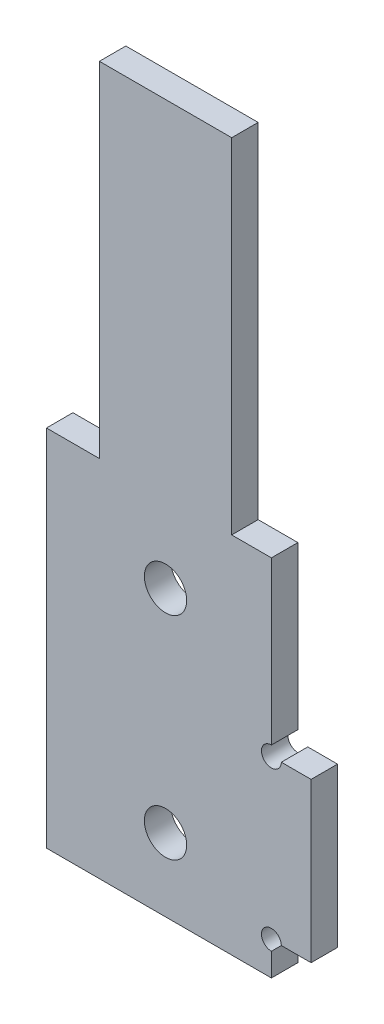
ISO-10303-21;
HEADER;
FILE_DESCRIPTION(('STEP AP214'),'2;1');
FILE_NAME('part.step','',(''),(''),'','','');
FILE_SCHEMA(('AUTOMOTIVE_DESIGN { 1 0 10303 214 1 1 1 1 }'));
ENDSEC;
DATA;
#1=APPLICATION_CONTEXT('core data for automotive mechanical design processes');
#2=APPLICATION_PROTOCOL_DEFINITION('international standard','automotive_design',2000,#1);
#3=PRODUCT_CONTEXT('',#1,'mechanical');
#4=PRODUCT('Part','Part','',(#3));
#5=PRODUCT_RELATED_PRODUCT_CATEGORY('part','',(#4));
#6=PRODUCT_DEFINITION_FORMATION('','',#4);
#7=PRODUCT_DEFINITION_CONTEXT('part definition',#1,'design');
#8=PRODUCT_DEFINITION('design','',#6,#7);
#9=PRODUCT_DEFINITION_SHAPE('','',#8);
#10=(LENGTH_UNIT() NAMED_UNIT(*) SI_UNIT(.MILLI.,.METRE.));
#11=(NAMED_UNIT(*) PLANE_ANGLE_UNIT() SI_UNIT($,.RADIAN.));
#12=(NAMED_UNIT(*) SI_UNIT($,.STERADIAN.) SOLID_ANGLE_UNIT());
#13=UNCERTAINTY_MEASURE_WITH_UNIT(LENGTH_MEASURE(1.E-05),#10,'distance_accuracy_value','');
#14=(GEOMETRIC_REPRESENTATION_CONTEXT(3) GLOBAL_UNCERTAINTY_ASSIGNED_CONTEXT((#13)) GLOBAL_UNIT_ASSIGNED_CONTEXT((#10,
#11,#12)) REPRESENTATION_CONTEXT('',''));
#15=CARTESIAN_POINT('',(0.,0.,0.));
#16=DIRECTION('',(0.,0.,1.));
#17=DIRECTION('',(1.,0.,0.));
#18=AXIS2_PLACEMENT_3D('',#15,#16,#17);
#19=CARTESIAN_POINT('',(0.,0.,2.));
#20=DIRECTION('',(1.,0.,0.));
#21=DIRECTION('',(0.,0.,-1.));
#22=AXIS2_PLACEMENT_3D('',#19,#20,#21);
#23=PLANE('',#22);
#24=DIRECTION('',(0.,-1.,0.));
#25=VECTOR('',#24,1.);
#26=CARTESIAN_POINT('',(0.,0.,2.));
#27=LINE('',#26,#25);
#28=CARTESIAN_POINT('',(0.,27.5,2.));
#29=VERTEX_POINT('',#28);
#30=CARTESIAN_POINT('',(0.,0.,2.));
#31=VERTEX_POINT('',#30);
#32=EDGE_CURVE('E182',#29,#31,#27,.T.);
#33=ORIENTED_EDGE('',*,*,#32,.F.);
#34=DIRECTION('',(0.,0.,1.));
#35=VECTOR('',#34,1.);
#36=CARTESIAN_POINT('',(0.,27.5,0.));
#37=LINE('',#36,#35);
#38=CARTESIAN_POINT('',(0.,27.5,0.));
#39=VERTEX_POINT('',#38);
#40=EDGE_CURVE('E201',#39,#29,#37,.T.);
#41=ORIENTED_EDGE('',*,*,#40,.F.);
#42=DIRECTION('',(0.,-1.,0.));
#43=VECTOR('',#42,1.);
#44=CARTESIAN_POINT('',(0.,0.,0.));
#45=LINE('',#44,#43);
#46=CARTESIAN_POINT('',(0.,0.,0.));
#47=VERTEX_POINT('',#46);
#48=EDGE_CURVE('E165',#39,#47,#45,.T.);
#49=ORIENTED_EDGE('',*,*,#48,.T.);
#50=DIRECTION('',(0.,0.,-1.));
#51=VECTOR('',#50,1.);
#52=CARTESIAN_POINT('',(0.,0.,2.));
#53=LINE('',#52,#51);
#54=EDGE_CURVE('E189',#31,#47,#53,.T.);
#55=ORIENTED_EDGE('',*,*,#54,.F.);
#56=EDGE_LOOP('',(#33,#41,#49,#55));
#57=FACE_BOUND('',#56,.T.);
#58=ADVANCED_FACE('F34',(#57),#23,.F.);
#59=CARTESIAN_POINT('',(0.,0.,2.));
#60=DIRECTION('',(0.,1.,0.));
#61=DIRECTION('',(-1.,0.,0.));
#62=AXIS2_PLACEMENT_3D('',#59,#60,#61);
#63=PLANE('',#62);
#64=DIRECTION('',(1.,0.,0.));
#65=VECTOR('',#64,1.);
#66=CARTESIAN_POINT('',(0.,0.,0.));
#67=LINE('',#66,#65);
#68=CARTESIAN_POINT('',(17.,0.,0.));
#69=VERTEX_POINT('',#68);
#70=EDGE_CURVE('E167',#47,#69,#67,.T.);
#71=ORIENTED_EDGE('',*,*,#70,.T.);
#72=DIRECTION('',(0.,0.,-1.));
#73=VECTOR('',#72,1.);
#74=CARTESIAN_POINT('',(17.,0.,2.));
#75=LINE('',#74,#73);
#76=CARTESIAN_POINT('',(17.,0.,2.));
#77=VERTEX_POINT('',#76);
#78=EDGE_CURVE('E186',#77,#69,#75,.T.);
#79=ORIENTED_EDGE('',*,*,#78,.F.);
#80=DIRECTION('',(1.,0.,0.));
#81=VECTOR('',#80,1.);
#82=CARTESIAN_POINT('',(0.,0.,2.));
#83=LINE('',#82,#81);
#84=EDGE_CURVE('E157',#31,#77,#83,.T.);
#85=ORIENTED_EDGE('',*,*,#84,.F.);
#86=ORIENTED_EDGE('',*,*,#54,.T.);
#87=EDGE_LOOP('',(#71,#79,#85,#86));
#88=FACE_BOUND('',#87,.T.);
#89=ADVANCED_FACE('F194',(#88),#63,.F.);
#90=CARTESIAN_POINT('',(17.,0.,2.));
#91=DIRECTION('',(-1.,0.,0.));
#92=DIRECTION('',(0.,0.,1.));
#93=AXIS2_PLACEMENT_3D('',#90,#91,#92);
#94=PLANE('',#93);
#95=DIRECTION('',(0.,1.,0.));
#96=VECTOR('',#95,1.);
#97=CARTESIAN_POINT('',(17.,0.,0.));
#98=LINE('',#97,#96);
#99=CARTESIAN_POINT('',(17.,1.75,0.));
#100=VERTEX_POINT('',#99);
#101=EDGE_CURVE('E170',#69,#100,#98,.T.);
#102=ORIENTED_EDGE('',*,*,#101,.T.);
#103=DIRECTION('',(0.,0.,1.));
#104=VECTOR('',#103,1.);
#105=CARTESIAN_POINT('',(17.,1.75,-1.));
#106=LINE('',#105,#104);
#107=CARTESIAN_POINT('',(17.,1.75,2.));
#108=VERTEX_POINT('',#107);
#109=EDGE_CURVE('E48',#100,#108,#106,.T.);
#110=ORIENTED_EDGE('',*,*,#109,.T.);
#111=DIRECTION('',(0.,1.,0.));
#112=VECTOR('',#111,1.);
#113=CARTESIAN_POINT('',(17.,0.,2.));
#114=LINE('',#113,#112);
#115=EDGE_CURVE('E147',#77,#108,#114,.T.);
#116=ORIENTED_EDGE('',*,*,#115,.F.);
#117=ORIENTED_EDGE('',*,*,#78,.T.);
#118=EDGE_LOOP('',(#102,#110,#116,#117));
#119=FACE_BOUND('',#118,.T.);
#120=ADVANCED_FACE('F208',(#119),#94,.F.);
#121=CARTESIAN_POINT('',(20.,2.5,2.));
#122=DIRECTION('',(0.,1.,0.));
#123=DIRECTION('',(0.,0.,1.));
#124=AXIS2_PLACEMENT_3D('',#121,#122,#123);
#125=PLANE('',#124);
#126=DIRECTION('',(1.,0.,0.));
#127=VECTOR('',#126,1.);
#128=CARTESIAN_POINT('',(20.,2.5,2.));
#129=LINE('',#128,#127);
#130=CARTESIAN_POINT('',(17.75,2.5,2.));
#131=VERTEX_POINT('',#130);
#132=CARTESIAN_POINT('',(20.,2.5,2.));
#133=VERTEX_POINT('',#132);
#134=EDGE_CURVE('E144',#131,#133,#129,.T.);
#135=ORIENTED_EDGE('',*,*,#134,.F.);
#136=DIRECTION('',(0.,0.,1.));
#137=VECTOR('',#136,1.);
#138=CARTESIAN_POINT('',(17.75,2.5,-1.));
#139=LINE('',#138,#137);
#140=CARTESIAN_POINT('',(17.75,2.5,0.));
#141=VERTEX_POINT('',#140);
#142=EDGE_CURVE('E131',#131,#141,#139,.F.);
#143=ORIENTED_EDGE('',*,*,#142,.T.);
#144=DIRECTION('',(1.,0.,0.));
#145=VECTOR('',#144,1.);
#146=CARTESIAN_POINT('',(20.,2.5,0.));
#147=LINE('',#146,#145);
#148=CARTESIAN_POINT('',(20.,2.5,0.));
#149=VERTEX_POINT('',#148);
#150=EDGE_CURVE('E173',#141,#149,#147,.T.);
#151=ORIENTED_EDGE('',*,*,#150,.T.);
#152=DIRECTION('',(0.,0.,-1.));
#153=VECTOR('',#152,1.);
#154=CARTESIAN_POINT('',(20.,2.5,2.));
#155=LINE('',#154,#153);
#156=EDGE_CURVE('E151',#133,#149,#155,.T.);
#157=ORIENTED_EDGE('',*,*,#156,.F.);
#158=EDGE_LOOP('',(#135,#143,#151,#157));
#159=FACE_BOUND('',#158,.T.);
#160=ADVANCED_FACE('F149',(#159),#125,.F.);
#161=CARTESIAN_POINT('',(20.,2.5,2.));
#162=DIRECTION('',(-1.,0.,0.));
#163=DIRECTION('',(0.,-1.,0.));
#164=AXIS2_PLACEMENT_3D('',#161,#162,#163);
#165=PLANE('',#164);
#166=DIRECTION('',(0.,1.,0.));
#167=VECTOR('',#166,1.);
#168=CARTESIAN_POINT('',(20.,2.5,0.));
#169=LINE('',#168,#167);
#170=CARTESIAN_POINT('',(20.,14.5,0.));
#171=VERTEX_POINT('',#170);
#172=EDGE_CURVE('E175',#149,#171,#169,.T.);
#173=ORIENTED_EDGE('',*,*,#172,.T.);
#174=DIRECTION('',(0.,0.,-1.));
#175=VECTOR('',#174,1.);
#176=CARTESIAN_POINT('',(20.,14.5,2.));
#177=LINE('',#176,#175);
#178=CARTESIAN_POINT('',(20.,14.5,2.));
#179=VERTEX_POINT('',#178);
#180=EDGE_CURVE('E164',#179,#171,#177,.T.);
#181=ORIENTED_EDGE('',*,*,#180,.F.);
#182=DIRECTION('',(0.,1.,0.));
#183=VECTOR('',#182,1.);
#184=CARTESIAN_POINT('',(20.,2.5,2.));
#185=LINE('',#184,#183);
#186=EDGE_CURVE('E153',#133,#179,#185,.T.);
#187=ORIENTED_EDGE('',*,*,#186,.F.);
#188=ORIENTED_EDGE('',*,*,#156,.T.);
#189=EDGE_LOOP('',(#173,#181,#187,#188));
#190=FACE_BOUND('',#189,.T.);
#191=ADVANCED_FACE('F301',(#190),#165,.F.);
#192=CARTESIAN_POINT('',(20.,14.5,2.));
#193=DIRECTION('',(0.,-1.,0.));
#194=DIRECTION('',(1.,0.,0.));
#195=AXIS2_PLACEMENT_3D('',#192,#193,#194);
#196=PLANE('',#195);
#197=DIRECTION('',(-1.,0.,0.));
#198=VECTOR('',#197,1.);
#199=CARTESIAN_POINT('',(20.,14.5,0.));
#200=LINE('',#199,#198);
#201=CARTESIAN_POINT('',(17.75,14.5,0.));
#202=VERTEX_POINT('',#201);
#203=EDGE_CURVE('E177',#171,#202,#200,.T.);
#204=ORIENTED_EDGE('',*,*,#203,.T.);
#205=DIRECTION('',(0.,0.,1.));
#206=VECTOR('',#205,1.);
#207=CARTESIAN_POINT('',(17.75,14.5,-1.));
#208=LINE('',#207,#206);
#209=CARTESIAN_POINT('',(17.75,14.5,2.));
#210=VERTEX_POINT('',#209);
#211=EDGE_CURVE('E55',#202,#210,#208,.T.);
#212=ORIENTED_EDGE('',*,*,#211,.T.);
#213=DIRECTION('',(-1.,0.,0.));
#214=VECTOR('',#213,1.);
#215=CARTESIAN_POINT('',(20.,14.5,2.));
#216=LINE('',#215,#214);
#217=EDGE_CURVE('E155',#179,#210,#216,.T.);
#218=ORIENTED_EDGE('',*,*,#217,.F.);
#219=ORIENTED_EDGE('',*,*,#180,.T.);
#220=EDGE_LOOP('',(#204,#212,#218,#219));
#221=FACE_BOUND('',#220,.T.);
#222=ADVANCED_FACE('F297',(#221),#196,.F.);
#223=CARTESIAN_POINT('',(17.,51.5,2.));
#224=DIRECTION('',(-1.,0.,0.));
#225=DIRECTION('',(0.,-1.,0.));
#226=AXIS2_PLACEMENT_3D('',#223,#224,#225);
#227=PLANE('',#226);
#228=DIRECTION('',(0.,1.,0.));
#229=VECTOR('',#228,1.);
#230=CARTESIAN_POINT('',(17.,51.5,2.));
#231=LINE('',#230,#229);
#232=CARTESIAN_POINT('',(17.,15.25,2.));
#233=VERTEX_POINT('',#232);
#234=CARTESIAN_POINT('',(17.,27.5,2.));
#235=VERTEX_POINT('',#234);
#236=EDGE_CURVE('E162',#233,#235,#231,.T.);
#237=ORIENTED_EDGE('',*,*,#236,.F.);
#238=DIRECTION('',(0.,0.,1.));
#239=VECTOR('',#238,1.);
#240=CARTESIAN_POINT('',(17.,15.25,-1.));
#241=LINE('',#240,#239);
#242=CARTESIAN_POINT('',(17.,15.25,0.));
#243=VERTEX_POINT('',#242);
#244=EDGE_CURVE('E209',#233,#243,#241,.F.);
#245=ORIENTED_EDGE('',*,*,#244,.T.);
#246=DIRECTION('',(0.,1.,0.));
#247=VECTOR('',#246,1.);
#248=CARTESIAN_POINT('',(17.,51.5,0.));
#249=LINE('',#248,#247);
#250=CARTESIAN_POINT('',(17.,27.5,0.));
#251=VERTEX_POINT('',#250);
#252=EDGE_CURVE('E180',#243,#251,#249,.T.);
#253=ORIENTED_EDGE('',*,*,#252,.T.);
#254=DIRECTION('',(0.,0.,1.));
#255=VECTOR('',#254,1.);
#256=CARTESIAN_POINT('',(17.,27.5,0.));
#257=LINE('',#256,#255);
#258=EDGE_CURVE('E242',#251,#235,#257,.T.);
#259=ORIENTED_EDGE('',*,*,#258,.T.);
#260=EDGE_LOOP('',(#237,#245,#253,#259));
#261=FACE_BOUND('',#260,.T.);
#262=ADVANCED_FACE('F290',(#261),#227,.F.);
#263=CARTESIAN_POINT('',(0.,0.,2.));
#264=DIRECTION('',(0.,0.,-1.));
#265=DIRECTION('',(-1.,0.,0.));
#266=AXIS2_PLACEMENT_3D('',#263,#264,#265);
#267=PLANE('',#266);
#268=CARTESIAN_POINT('',(9.,5.5,2.));
#269=DIRECTION('',(0.,0.,1.));
#270=DIRECTION('',(1.,0.,0.));
#271=AXIS2_PLACEMENT_3D('',#268,#269,#270);
#272=CIRCLE('',#271,1.6);
#273=CARTESIAN_POINT('',(10.6,5.5,2.));
#274=VERTEX_POINT('',#273);
#275=EDGE_CURVE('E259',#274,#274,#272,.T.);
#276=ORIENTED_EDGE('',*,*,#275,.F.);
#277=EDGE_LOOP('',(#276));
#278=FACE_BOUND('',#277,.T.);
#279=CARTESIAN_POINT('',(9.,21.5,2.));
#280=DIRECTION('',(0.,0.,1.));
#281=DIRECTION('',(1.,0.,0.));
#282=AXIS2_PLACEMENT_3D('',#279,#280,#281);
#283=CIRCLE('',#282,1.6);
#284=CARTESIAN_POINT('',(10.6,21.5,2.));
#285=VERTEX_POINT('',#284);
#286=EDGE_CURVE('E245',#285,#285,#283,.T.);
#287=ORIENTED_EDGE('',*,*,#286,.F.);
#288=EDGE_LOOP('',(#287));
#289=FACE_BOUND('',#288,.T.);
#290=ORIENTED_EDGE('',*,*,#217,.T.);
#291=CARTESIAN_POINT('',(17.,14.5,2.));
#292=DIRECTION('',(0.,0.,1.));
#293=DIRECTION('',(1.,0.,0.));
#294=AXIS2_PLACEMENT_3D('',#291,#292,#293);
#295=CIRCLE('',#294,0.750000000000002);
#296=EDGE_CURVE('E138',#233,#210,#295,.T.);
#297=ORIENTED_EDGE('',*,*,#296,.F.);
#298=ORIENTED_EDGE('',*,*,#236,.T.);
#299=DIRECTION('',(1.,0.,0.));
#300=VECTOR('',#299,1.);
#301=CARTESIAN_POINT('',(17.,27.5,2.));
#302=LINE('',#301,#300);
#303=CARTESIAN_POINT('',(14.,27.5,2.));
#304=VERTEX_POINT('',#303);
#305=EDGE_CURVE('E232',#304,#235,#302,.T.);
#306=ORIENTED_EDGE('',*,*,#305,.F.);
#307=DIRECTION('',(0.,-1.,0.));
#308=VECTOR('',#307,1.);
#309=CARTESIAN_POINT('',(14.,51.5,2.));
#310=LINE('',#309,#308);
#311=CARTESIAN_POINT('',(14.,53.5,2.));
#312=VERTEX_POINT('',#311);
#313=EDGE_CURVE('E236',#312,#304,#310,.T.);
#314=ORIENTED_EDGE('',*,*,#313,.F.);
#315=DIRECTION('',(1.,0.,0.));
#316=VECTOR('',#315,1.);
#317=CARTESIAN_POINT('',(4.,53.5,2.));
#318=LINE('',#317,#316);
#319=CARTESIAN_POINT('',(4.,53.5,2.));
#320=VERTEX_POINT('',#319);
#321=EDGE_CURVE('E218',#320,#312,#318,.T.);
#322=ORIENTED_EDGE('',*,*,#321,.F.);
#323=DIRECTION('',(0.,1.,0.));
#324=VECTOR('',#323,1.);
#325=CARTESIAN_POINT('',(4.,51.5,2.));
#326=LINE('',#325,#324);
#327=CARTESIAN_POINT('',(4.,27.5,2.));
#328=VERTEX_POINT('',#327);
#329=EDGE_CURVE('E250',#328,#320,#326,.T.);
#330=ORIENTED_EDGE('',*,*,#329,.F.);
#331=DIRECTION('',(1.,0.,0.));
#332=VECTOR('',#331,1.);
#333=CARTESIAN_POINT('',(0.,27.5,2.));
#334=LINE('',#333,#332);
#335=EDGE_CURVE('E227',#29,#328,#334,.T.);
#336=ORIENTED_EDGE('',*,*,#335,.F.);
#337=ORIENTED_EDGE('',*,*,#32,.T.);
#338=ORIENTED_EDGE('',*,*,#84,.T.);
#339=ORIENTED_EDGE('',*,*,#115,.T.);
#340=CARTESIAN_POINT('',(17.,2.5,2.));
#341=DIRECTION('',(0.,0.,1.));
#342=DIRECTION('',(1.,0.,0.));
#343=AXIS2_PLACEMENT_3D('',#340,#341,#342);
#344=CIRCLE('',#343,0.750000000000002);
#345=EDGE_CURVE('E134',#131,#108,#344,.T.);
#346=ORIENTED_EDGE('',*,*,#345,.F.);
#347=ORIENTED_EDGE('',*,*,#134,.T.);
#348=ORIENTED_EDGE('',*,*,#186,.T.);
#349=EDGE_LOOP('',(#290,#297,#298,#306,#314,#322,#330,#336,#337,#338,#339,#346,#347,#348));
#350=FACE_BOUND('',#349,.T.);
#351=ADVANCED_FACE('F143',(#278,#289,#350),#267,.F.);
#352=CARTESIAN_POINT('',(0.,0.,0.));
#353=DIRECTION('',(0.,0.,-1.));
#354=DIRECTION('',(-1.,0.,0.));
#355=AXIS2_PLACEMENT_3D('',#352,#353,#354);
#356=PLANE('',#355);
#357=CARTESIAN_POINT('',(17.,14.5,0.));
#358=DIRECTION('',(0.,0.,-1.));
#359=DIRECTION('',(-1.,0.,0.));
#360=AXIS2_PLACEMENT_3D('',#357,#358,#359);
#361=CIRCLE('',#360,0.750000000000002);
#362=EDGE_CURVE('E11',#202,#243,#361,.T.);
#363=ORIENTED_EDGE('',*,*,#362,.F.);
#364=ORIENTED_EDGE('',*,*,#203,.F.);
#365=ORIENTED_EDGE('',*,*,#172,.F.);
#366=ORIENTED_EDGE('',*,*,#150,.F.);
#367=CARTESIAN_POINT('',(17.,2.5,0.));
#368=DIRECTION('',(0.,0.,-1.));
#369=DIRECTION('',(-1.,0.,0.));
#370=AXIS2_PLACEMENT_3D('',#367,#368,#369);
#371=CIRCLE('',#370,0.750000000000002);
#372=EDGE_CURVE('E41',#100,#141,#371,.T.);
#373=ORIENTED_EDGE('',*,*,#372,.F.);
#374=ORIENTED_EDGE('',*,*,#101,.F.);
#375=ORIENTED_EDGE('',*,*,#70,.F.);
#376=ORIENTED_EDGE('',*,*,#48,.F.);
#377=DIRECTION('',(1.,0.,0.));
#378=VECTOR('',#377,1.);
#379=CARTESIAN_POINT('',(0.,27.5,0.));
#380=LINE('',#379,#378);
#381=CARTESIAN_POINT('',(4.,27.5,0.));
#382=VERTEX_POINT('',#381);
#383=EDGE_CURVE('E247',#39,#382,#380,.T.);
#384=ORIENTED_EDGE('',*,*,#383,.T.);
#385=DIRECTION('',(0.,1.,0.));
#386=VECTOR('',#385,1.);
#387=CARTESIAN_POINT('',(4.,51.5,0.));
#388=LINE('',#387,#386);
#389=CARTESIAN_POINT('',(4.,53.5,0.));
#390=VERTEX_POINT('',#389);
#391=EDGE_CURVE('E249',#382,#390,#388,.T.);
#392=ORIENTED_EDGE('',*,*,#391,.T.);
#393=DIRECTION('',(-1.,0.,0.));
#394=VECTOR('',#393,1.);
#395=CARTESIAN_POINT('',(4.,53.5,0.));
#396=LINE('',#395,#394);
#397=CARTESIAN_POINT('',(14.,53.5,0.));
#398=VERTEX_POINT('',#397);
#399=EDGE_CURVE('E224',#398,#390,#396,.T.);
#400=ORIENTED_EDGE('',*,*,#399,.F.);
#401=DIRECTION('',(0.,-1.,0.));
#402=VECTOR('',#401,1.);
#403=CARTESIAN_POINT('',(14.,51.5,0.));
#404=LINE('',#403,#402);
#405=CARTESIAN_POINT('',(14.,27.5,0.));
#406=VERTEX_POINT('',#405);
#407=EDGE_CURVE('E228',#398,#406,#404,.T.);
#408=ORIENTED_EDGE('',*,*,#407,.T.);
#409=DIRECTION('',(1.,0.,0.));
#410=VECTOR('',#409,1.);
#411=CARTESIAN_POINT('',(17.,27.5,0.));
#412=LINE('',#411,#410);
#413=EDGE_CURVE('E231',#406,#251,#412,.T.);
#414=ORIENTED_EDGE('',*,*,#413,.T.);
#415=ORIENTED_EDGE('',*,*,#252,.F.);
#416=EDGE_LOOP('',(#363,#364,#365,#366,#373,#374,#375,#376,#384,#392,#400,#408,#414,#415));
#417=FACE_BOUND('',#416,.T.);
#418=CARTESIAN_POINT('',(9.,5.5,0.));
#419=DIRECTION('',(0.,0.,1.));
#420=DIRECTION('',(1.,0.,0.));
#421=AXIS2_PLACEMENT_3D('',#418,#419,#420);
#422=CIRCLE('',#421,1.6);
#423=CARTESIAN_POINT('',(10.6,5.5,0.));
#424=VERTEX_POINT('',#423);
#425=EDGE_CURVE('E168',#424,#424,#422,.T.);
#426=ORIENTED_EDGE('',*,*,#425,.T.);
#427=EDGE_LOOP('',(#426));
#428=FACE_BOUND('',#427,.T.);
#429=CARTESIAN_POINT('',(9.,21.5,0.));
#430=DIRECTION('',(0.,0.,1.));
#431=DIRECTION('',(1.,0.,0.));
#432=AXIS2_PLACEMENT_3D('',#429,#430,#431);
#433=CIRCLE('',#432,1.6);
#434=CARTESIAN_POINT('',(10.6,21.5,0.));
#435=VERTEX_POINT('',#434);
#436=EDGE_CURVE('E262',#435,#435,#433,.T.);
#437=ORIENTED_EDGE('',*,*,#436,.T.);
#438=EDGE_LOOP('',(#437));
#439=FACE_BOUND('',#438,.T.);
#440=ADVANCED_FACE('F205',(#417,#428,#439),#356,.T.);
#441=CARTESIAN_POINT('',(9.,21.5,0.));
#442=DIRECTION('',(0.,0.,1.));
#443=DIRECTION('',(1.,0.,0.));
#444=AXIS2_PLACEMENT_3D('',#441,#442,#443);
#445=CYLINDRICAL_SURFACE('',#444,1.6);
#446=ORIENTED_EDGE('',*,*,#436,.F.);
#447=EDGE_LOOP('',(#446));
#448=FACE_BOUND('',#447,.T.);
#449=ORIENTED_EDGE('',*,*,#286,.T.);
#450=EDGE_LOOP('',(#449));
#451=FACE_BOUND('',#450,.T.);
#452=ADVANCED_FACE('F360',(#448,#451),#445,.F.);
#453=CARTESIAN_POINT('',(9.,5.5,0.));
#454=DIRECTION('',(0.,0.,1.));
#455=DIRECTION('',(1.,0.,0.));
#456=AXIS2_PLACEMENT_3D('',#453,#454,#455);
#457=CYLINDRICAL_SURFACE('',#456,1.6);
#458=ORIENTED_EDGE('',*,*,#425,.F.);
#459=EDGE_LOOP('',(#458));
#460=FACE_BOUND('',#459,.T.);
#461=ORIENTED_EDGE('',*,*,#275,.T.);
#462=EDGE_LOOP('',(#461));
#463=FACE_BOUND('',#462,.T.);
#464=ADVANCED_FACE('F393',(#460,#463),#457,.F.);
#465=CARTESIAN_POINT('',(4.,51.5,0.));
#466=DIRECTION('',(1.,0.,0.));
#467=DIRECTION('',(0.,1.,0.));
#468=AXIS2_PLACEMENT_3D('',#465,#466,#467);
#469=PLANE('',#468);
#470=ORIENTED_EDGE('',*,*,#329,.T.);
#471=DIRECTION('',(0.,0.,1.));
#472=VECTOR('',#471,1.);
#473=CARTESIAN_POINT('',(4.,53.5,0.));
#474=LINE('',#473,#472);
#475=EDGE_CURVE('E215',#390,#320,#474,.T.);
#476=ORIENTED_EDGE('',*,*,#475,.F.);
#477=ORIENTED_EDGE('',*,*,#391,.F.);
#478=DIRECTION('',(0.,0.,1.));
#479=VECTOR('',#478,1.);
#480=CARTESIAN_POINT('',(4.,27.5,0.));
#481=LINE('',#480,#479);
#482=EDGE_CURVE('E239',#382,#328,#481,.T.);
#483=ORIENTED_EDGE('',*,*,#482,.T.);
#484=EDGE_LOOP('',(#470,#476,#477,#483));
#485=FACE_BOUND('',#484,.T.);
#486=ADVANCED_FACE('F279',(#485),#469,.F.);
#487=CARTESIAN_POINT('',(0.,27.5,0.));
#488=DIRECTION('',(0.,-1.,0.));
#489=DIRECTION('',(1.,0.,0.));
#490=AXIS2_PLACEMENT_3D('',#487,#488,#489);
#491=PLANE('',#490);
#492=ORIENTED_EDGE('',*,*,#335,.T.);
#493=ORIENTED_EDGE('',*,*,#482,.F.);
#494=ORIENTED_EDGE('',*,*,#383,.F.);
#495=ORIENTED_EDGE('',*,*,#40,.T.);
#496=EDGE_LOOP('',(#492,#493,#494,#495));
#497=FACE_BOUND('',#496,.T.);
#498=ADVANCED_FACE('F272',(#497),#491,.F.);
#499=CARTESIAN_POINT('',(17.,27.5,0.));
#500=DIRECTION('',(0.,-1.,0.));
#501=DIRECTION('',(0.,0.,-1.));
#502=AXIS2_PLACEMENT_3D('',#499,#500,#501);
#503=PLANE('',#502);
#504=ORIENTED_EDGE('',*,*,#305,.T.);
#505=ORIENTED_EDGE('',*,*,#258,.F.);
#506=ORIENTED_EDGE('',*,*,#413,.F.);
#507=DIRECTION('',(0.,0.,1.));
#508=VECTOR('',#507,1.);
#509=CARTESIAN_POINT('',(14.,27.5,0.));
#510=LINE('',#509,#508);
#511=EDGE_CURVE('E235',#406,#304,#510,.T.);
#512=ORIENTED_EDGE('',*,*,#511,.T.);
#513=EDGE_LOOP('',(#504,#505,#506,#512));
#514=FACE_BOUND('',#513,.T.);
#515=ADVANCED_FACE('F287',(#514),#503,.F.);
#516=CARTESIAN_POINT('',(14.,51.5,0.));
#517=DIRECTION('',(-1.,0.,0.));
#518=DIRECTION('',(0.,-1.,0.));
#519=AXIS2_PLACEMENT_3D('',#516,#517,#518);
#520=PLANE('',#519);
#521=ORIENTED_EDGE('',*,*,#313,.T.);
#522=ORIENTED_EDGE('',*,*,#511,.F.);
#523=ORIENTED_EDGE('',*,*,#407,.F.);
#524=DIRECTION('',(0.,0.,-1.));
#525=VECTOR('',#524,1.);
#526=CARTESIAN_POINT('',(14.,53.5,0.));
#527=LINE('',#526,#525);
#528=EDGE_CURVE('E221',#312,#398,#527,.T.);
#529=ORIENTED_EDGE('',*,*,#528,.F.);
#530=EDGE_LOOP('',(#521,#522,#523,#529));
#531=FACE_BOUND('',#530,.T.);
#532=ADVANCED_FACE('F282',(#531),#520,.F.);
#533=CARTESIAN_POINT('',(0.,53.5,0.));
#534=DIRECTION('',(0.,1.,0.));
#535=DIRECTION('',(0.,0.,1.));
#536=AXIS2_PLACEMENT_3D('',#533,#534,#535);
#537=PLANE('',#536);
#538=ORIENTED_EDGE('',*,*,#475,.T.);
#539=ORIENTED_EDGE('',*,*,#321,.T.);
#540=ORIENTED_EDGE('',*,*,#528,.T.);
#541=ORIENTED_EDGE('',*,*,#399,.T.);
#542=EDGE_LOOP('',(#538,#539,#540,#541));
#543=FACE_BOUND('',#542,.T.);
#544=ADVANCED_FACE('F277',(#543),#537,.T.);
#545=CARTESIAN_POINT('',(17.,2.5,-1.));
#546=DIRECTION('',(0.,0.,1.));
#547=DIRECTION('',(1.,0.,0.));
#548=AXIS2_PLACEMENT_3D('',#545,#546,#547);
#549=CYLINDRICAL_SURFACE('',#548,0.750000000000002);
#550=ORIENTED_EDGE('',*,*,#372,.T.);
#551=ORIENTED_EDGE('',*,*,#142,.F.);
#552=ORIENTED_EDGE('',*,*,#345,.T.);
#553=ORIENTED_EDGE('',*,*,#109,.F.);
#554=EDGE_LOOP('',(#550,#551,#552,#553));
#555=FACE_BOUND('',#554,.T.);
#556=ADVANCED_FACE('F133',(#555),#549,.F.);
#557=CARTESIAN_POINT('',(17.,14.5,-1.));
#558=DIRECTION('',(0.,0.,1.));
#559=DIRECTION('',(1.,0.,0.));
#560=AXIS2_PLACEMENT_3D('',#557,#558,#559);
#561=CYLINDRICAL_SURFACE('',#560,0.750000000000002);
#562=ORIENTED_EDGE('',*,*,#362,.T.);
#563=ORIENTED_EDGE('',*,*,#244,.F.);
#564=ORIENTED_EDGE('',*,*,#296,.T.);
#565=ORIENTED_EDGE('',*,*,#211,.F.);
#566=EDGE_LOOP('',(#562,#563,#564,#565));
#567=FACE_BOUND('',#566,.T.);
#568=ADVANCED_FACE('F292',(#567),#561,.F.);
#569=CLOSED_SHELL('',(#58,#89,#120,#160,#191,#222,#262,#351,#440,#452,#464,#486,#498,#515,#532,
#544,#556,#568));
#570=MANIFOLD_SOLID_BREP('B2',#569);
#571=ADVANCED_BREP_SHAPE_REPRESENTATION('',(#18,#570),#14);
#572=SHAPE_DEFINITION_REPRESENTATION(#9,#571);
ENDSEC;
END-ISO-10303-21;
